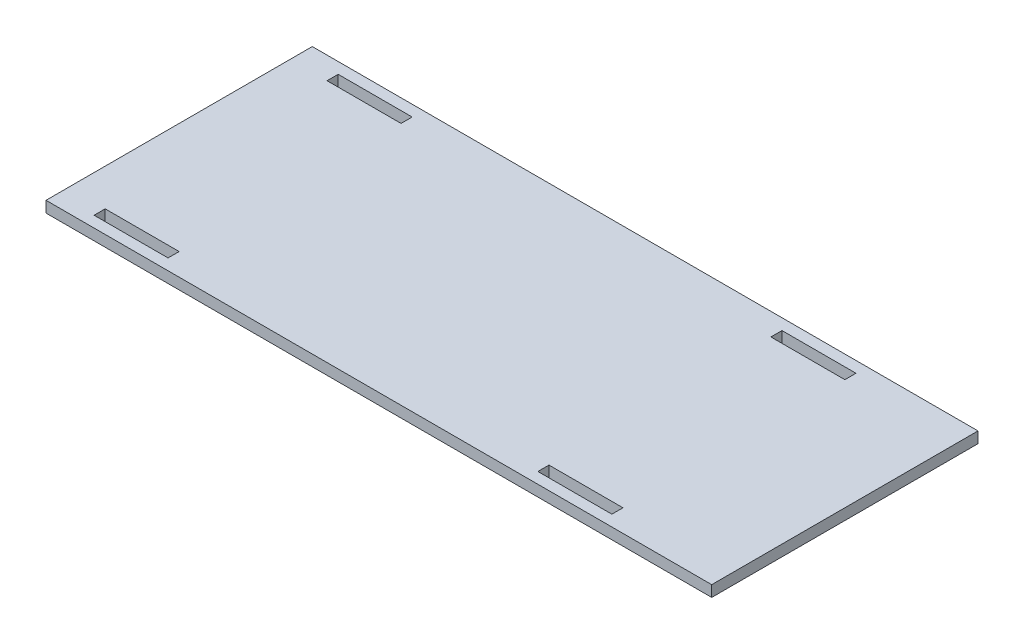
ISO-10303-21;
HEADER;
FILE_DESCRIPTION(('STEP AP214'),'2;1');
FILE_NAME('part.step','',(''),(''),'','','');
FILE_SCHEMA(('AUTOMOTIVE_DESIGN { 1 0 10303 214 1 1 1 1 }'));
ENDSEC;
DATA;
#1=APPLICATION_CONTEXT('core data for automotive mechanical design processes');
#2=APPLICATION_PROTOCOL_DEFINITION('international standard','automotive_design',2000,#1);
#3=PRODUCT_CONTEXT('',#1,'mechanical');
#4=PRODUCT('Part','Part','',(#3));
#5=PRODUCT_RELATED_PRODUCT_CATEGORY('part','',(#4));
#6=PRODUCT_DEFINITION_FORMATION('','',#4);
#7=PRODUCT_DEFINITION_CONTEXT('part definition',#1,'design');
#8=PRODUCT_DEFINITION('design','',#6,#7);
#9=PRODUCT_DEFINITION_SHAPE('','',#8);
#10=(LENGTH_UNIT() NAMED_UNIT(*) SI_UNIT(.MILLI.,.METRE.));
#11=(NAMED_UNIT(*) PLANE_ANGLE_UNIT() SI_UNIT($,.RADIAN.));
#12=(NAMED_UNIT(*) SI_UNIT($,.STERADIAN.) SOLID_ANGLE_UNIT());
#13=UNCERTAINTY_MEASURE_WITH_UNIT(LENGTH_MEASURE(1.E-05),#10,'distance_accuracy_value','');
#14=(GEOMETRIC_REPRESENTATION_CONTEXT(3) GLOBAL_UNCERTAINTY_ASSIGNED_CONTEXT((#13)) GLOBAL_UNIT_ASSIGNED_CONTEXT((#10,
#11,#12)) REPRESENTATION_CONTEXT('',''));
#15=CARTESIAN_POINT('',(0.,0.,0.));
#16=DIRECTION('',(0.,0.,1.));
#17=DIRECTION('',(1.,0.,0.));
#18=AXIS2_PLACEMENT_3D('',#15,#16,#17);
#19=CARTESIAN_POINT('',(0.,-3.,0.));
#20=DIRECTION('',(0.,-1.,0.));
#21=DIRECTION('',(0.,0.,-1.));
#22=AXIS2_PLACEMENT_3D('',#19,#20,#21);
#23=PLANE('',#22);
#24=DIRECTION('',(0.,0.,-1.));
#25=VECTOR('',#24,1.);
#26=CARTESIAN_POINT('',(-180.,-3.,3.));
#27=LINE('',#26,#25);
#28=CARTESIAN_POINT('',(-180.,-3.,3.));
#29=VERTEX_POINT('',#28);
#30=CARTESIAN_POINT('',(-180.,-3.,-69.));
#31=VERTEX_POINT('',#30);
#32=EDGE_CURVE('E301',#29,#31,#27,.T.);
#33=ORIENTED_EDGE('',*,*,#32,.T.);
#34=DIRECTION('',(1.,0.,0.));
#35=VECTOR('',#34,1.);
#36=CARTESIAN_POINT('',(-180.,-3.,-69.));
#37=LINE('',#36,#35);
#38=CARTESIAN_POINT('',(0.,-3.,-69.));
#39=VERTEX_POINT('',#38);
#40=EDGE_CURVE('E304',#31,#39,#37,.T.);
#41=ORIENTED_EDGE('',*,*,#40,.T.);
#42=DIRECTION('',(0.,0.,1.));
#43=VECTOR('',#42,1.);
#44=CARTESIAN_POINT('',(0.,-3.,3.));
#45=LINE('',#44,#43);
#46=CARTESIAN_POINT('',(0.,-3.,3.));
#47=VERTEX_POINT('',#46);
#48=EDGE_CURVE('E307',#39,#47,#45,.T.);
#49=ORIENTED_EDGE('',*,*,#48,.T.);
#50=DIRECTION('',(-1.,0.,0.));
#51=VECTOR('',#50,1.);
#52=CARTESIAN_POINT('',(-180.,-3.,3.));
#53=LINE('',#52,#51);
#54=EDGE_CURVE('E309',#47,#29,#53,.T.);
#55=ORIENTED_EDGE('',*,*,#54,.T.);
#56=EDGE_LOOP('',(#33,#41,#49,#55));
#57=FACE_BOUND('',#56,.T.);
#58=DIRECTION('',(-1.,0.,0.));
#59=VECTOR('',#58,1.);
#60=CARTESIAN_POINT('',(-150.,-3.,0.));
#61=LINE('',#60,#59);
#62=CARTESIAN_POINT('',(-150.,-3.,0.));
#63=VERTEX_POINT('',#62);
#64=CARTESIAN_POINT('',(-170.,-3.,0.));
#65=VERTEX_POINT('',#64);
#66=EDGE_CURVE('E272',#63,#65,#61,.T.);
#67=ORIENTED_EDGE('',*,*,#66,.F.);
#68=DIRECTION('',(0.,0.,1.));
#69=VECTOR('',#68,1.);
#70=CARTESIAN_POINT('',(-150.,-3.,-3.00000000000002));
#71=LINE('',#70,#69);
#72=CARTESIAN_POINT('',(-150.,-3.,-3.00000000000002));
#73=VERTEX_POINT('',#72);
#74=EDGE_CURVE('E270',#73,#63,#71,.T.);
#75=ORIENTED_EDGE('',*,*,#74,.F.);
#76=DIRECTION('',(1.,0.,0.));
#77=VECTOR('',#76,1.);
#78=CARTESIAN_POINT('',(-150.,-3.,-3.00000000000002));
#79=LINE('',#78,#77);
#80=CARTESIAN_POINT('',(-170.,-3.,-3.00000000000002));
#81=VERTEX_POINT('',#80);
#82=EDGE_CURVE('E278',#81,#73,#79,.T.);
#83=ORIENTED_EDGE('',*,*,#82,.F.);
#84=DIRECTION('',(0.,0.,-1.));
#85=VECTOR('',#84,1.);
#86=CARTESIAN_POINT('',(-170.,-3.,-3.00000000000002));
#87=LINE('',#86,#85);
#88=EDGE_CURVE('E275',#65,#81,#87,.T.);
#89=ORIENTED_EDGE('',*,*,#88,.F.);
#90=EDGE_LOOP('',(#67,#75,#83,#89));
#91=FACE_BOUND('',#90,.T.);
#92=DIRECTION('',(-1.,0.,0.));
#93=VECTOR('',#92,1.);
#94=CARTESIAN_POINT('',(-30.,-3.,0.));
#95=LINE('',#94,#93);
#96=CARTESIAN_POINT('',(-30.,-3.,0.));
#97=VERTEX_POINT('',#96);
#98=CARTESIAN_POINT('',(-50.,-3.,0.));
#99=VERTEX_POINT('',#98);
#100=EDGE_CURVE('E241',#97,#99,#95,.T.);
#101=ORIENTED_EDGE('',*,*,#100,.F.);
#102=DIRECTION('',(0.,0.,1.));
#103=VECTOR('',#102,1.);
#104=CARTESIAN_POINT('',(-30.,-3.,0.));
#105=LINE('',#104,#103);
#106=CARTESIAN_POINT('',(-30.,-3.,-3.00000000000002));
#107=VERTEX_POINT('',#106);
#108=EDGE_CURVE('E239',#107,#97,#105,.T.);
#109=ORIENTED_EDGE('',*,*,#108,.F.);
#110=DIRECTION('',(1.,0.,0.));
#111=VECTOR('',#110,1.);
#112=CARTESIAN_POINT('',(-30.,-3.,-3.00000000000002));
#113=LINE('',#112,#111);
#114=CARTESIAN_POINT('',(-50.,-3.,-3.00000000000002));
#115=VERTEX_POINT('',#114);
#116=EDGE_CURVE('E247',#115,#107,#113,.T.);
#117=ORIENTED_EDGE('',*,*,#116,.F.);
#118=DIRECTION('',(0.,0.,-1.));
#119=VECTOR('',#118,1.);
#120=CARTESIAN_POINT('',(-50.,-3.,0.));
#121=LINE('',#120,#119);
#122=EDGE_CURVE('E244',#99,#115,#121,.T.);
#123=ORIENTED_EDGE('',*,*,#122,.F.);
#124=EDGE_LOOP('',(#101,#109,#117,#123));
#125=FACE_BOUND('',#124,.T.);
#126=DIRECTION('',(-1.,0.,0.));
#127=VECTOR('',#126,1.);
#128=CARTESIAN_POINT('',(-30.,-3.,-63.));
#129=LINE('',#128,#127);
#130=CARTESIAN_POINT('',(-30.,-3.,-63.));
#131=VERTEX_POINT('',#130);
#132=CARTESIAN_POINT('',(-50.,-3.,-63.));
#133=VERTEX_POINT('',#132);
#134=EDGE_CURVE('E210',#131,#133,#129,.T.);
#135=ORIENTED_EDGE('',*,*,#134,.F.);
#136=DIRECTION('',(0.,0.,1.));
#137=VECTOR('',#136,1.);
#138=CARTESIAN_POINT('',(-30.,-3.,-63.));
#139=LINE('',#138,#137);
#140=CARTESIAN_POINT('',(-30.,-3.,-66.));
#141=VERTEX_POINT('',#140);
#142=EDGE_CURVE('E208',#141,#131,#139,.T.);
#143=ORIENTED_EDGE('',*,*,#142,.F.);
#144=DIRECTION('',(1.,0.,0.));
#145=VECTOR('',#144,1.);
#146=CARTESIAN_POINT('',(-30.,-3.,-66.));
#147=LINE('',#146,#145);
#148=CARTESIAN_POINT('',(-50.,-3.,-66.));
#149=VERTEX_POINT('',#148);
#150=EDGE_CURVE('E216',#149,#141,#147,.T.);
#151=ORIENTED_EDGE('',*,*,#150,.F.);
#152=DIRECTION('',(0.,0.,-1.));
#153=VECTOR('',#152,1.);
#154=CARTESIAN_POINT('',(-50.,-3.,-63.));
#155=LINE('',#154,#153);
#156=EDGE_CURVE('E213',#133,#149,#155,.T.);
#157=ORIENTED_EDGE('',*,*,#156,.F.);
#158=EDGE_LOOP('',(#135,#143,#151,#157));
#159=FACE_BOUND('',#158,.T.);
#160=DIRECTION('',(-1.,0.,0.));
#161=VECTOR('',#160,1.);
#162=CARTESIAN_POINT('',(-150.,-3.,-63.));
#163=LINE('',#162,#161);
#164=CARTESIAN_POINT('',(-150.,-3.,-63.));
#165=VERTEX_POINT('',#164);
#166=CARTESIAN_POINT('',(-170.,-3.,-63.));
#167=VERTEX_POINT('',#166);
#168=EDGE_CURVE('E180',#165,#167,#163,.T.);
#169=ORIENTED_EDGE('',*,*,#168,.F.);
#170=DIRECTION('',(0.,0.,1.));
#171=VECTOR('',#170,1.);
#172=CARTESIAN_POINT('',(-150.,-3.,-63.));
#173=LINE('',#172,#171);
#174=CARTESIAN_POINT('',(-150.,-3.,-66.));
#175=VERTEX_POINT('',#174);
#176=EDGE_CURVE('E172',#175,#165,#173,.T.);
#177=ORIENTED_EDGE('',*,*,#176,.F.);
#178=DIRECTION('',(1.,0.,0.));
#179=VECTOR('',#178,1.);
#180=CARTESIAN_POINT('',(-150.,-3.,-66.));
#181=LINE('',#180,#179);
#182=CARTESIAN_POINT('',(-170.,-3.,-66.));
#183=VERTEX_POINT('',#182);
#184=EDGE_CURVE('E194',#183,#175,#181,.T.);
#185=ORIENTED_EDGE('',*,*,#184,.F.);
#186=DIRECTION('',(0.,0.,-1.));
#187=VECTOR('',#186,1.);
#188=CARTESIAN_POINT('',(-170.,-3.,-63.));
#189=LINE('',#188,#187);
#190=EDGE_CURVE('E192',#167,#183,#189,.T.);
#191=ORIENTED_EDGE('',*,*,#190,.F.);
#192=EDGE_LOOP('',(#169,#177,#185,#191));
#193=FACE_BOUND('',#192,.T.);
#194=ADVANCED_FACE('F35',(#57,#91,#125,#159,#193),#23,.T.);
#195=CARTESIAN_POINT('',(0.,0.,0.));
#196=DIRECTION('',(0.,-1.,0.));
#197=DIRECTION('',(0.,0.,-1.));
#198=AXIS2_PLACEMENT_3D('',#195,#196,#197);
#199=PLANE('',#198);
#200=DIRECTION('',(0.,0.,1.));
#201=VECTOR('',#200,1.);
#202=CARTESIAN_POINT('',(-30.,0.,-63.));
#203=LINE('',#202,#201);
#204=CARTESIAN_POINT('',(-30.,0.,-66.));
#205=VERTEX_POINT('',#204);
#206=CARTESIAN_POINT('',(-30.,0.,-63.));
#207=VERTEX_POINT('',#206);
#208=EDGE_CURVE('E188',#205,#207,#203,.T.);
#209=ORIENTED_EDGE('',*,*,#208,.T.);
#210=DIRECTION('',(-1.,0.,0.));
#211=VECTOR('',#210,1.);
#212=CARTESIAN_POINT('',(-30.,0.,-63.));
#213=LINE('',#212,#211);
#214=CARTESIAN_POINT('',(-50.,0.,-63.));
#215=VERTEX_POINT('',#214);
#216=EDGE_CURVE('E221',#207,#215,#213,.T.);
#217=ORIENTED_EDGE('',*,*,#216,.T.);
#218=DIRECTION('',(0.,0.,-1.));
#219=VECTOR('',#218,1.);
#220=CARTESIAN_POINT('',(-50.,0.,-63.));
#221=LINE('',#220,#219);
#222=CARTESIAN_POINT('',(-50.,0.,-66.));
#223=VERTEX_POINT('',#222);
#224=EDGE_CURVE('E224',#215,#223,#221,.T.);
#225=ORIENTED_EDGE('',*,*,#224,.T.);
#226=DIRECTION('',(1.,0.,0.));
#227=VECTOR('',#226,1.);
#228=CARTESIAN_POINT('',(-30.,0.,-66.));
#229=LINE('',#228,#227);
#230=EDGE_CURVE('E211',#223,#205,#229,.T.);
#231=ORIENTED_EDGE('',*,*,#230,.T.);
#232=EDGE_LOOP('',(#209,#217,#225,#231));
#233=FACE_BOUND('',#232,.T.);
#234=DIRECTION('',(0.,0.,1.));
#235=VECTOR('',#234,1.);
#236=CARTESIAN_POINT('',(-150.,0.,-3.00000000000002));
#237=LINE('',#236,#235);
#238=CARTESIAN_POINT('',(-150.,0.,-3.00000000000002));
#239=VERTEX_POINT('',#238);
#240=CARTESIAN_POINT('',(-150.,0.,0.));
#241=VERTEX_POINT('',#240);
#242=EDGE_CURVE('E269',#239,#241,#237,.T.);
#243=ORIENTED_EDGE('',*,*,#242,.T.);
#244=DIRECTION('',(-1.,0.,0.));
#245=VECTOR('',#244,1.);
#246=CARTESIAN_POINT('',(-150.,0.,0.));
#247=LINE('',#246,#245);
#248=CARTESIAN_POINT('',(-170.,0.,0.));
#249=VERTEX_POINT('',#248);
#250=EDGE_CURVE('E283',#241,#249,#247,.T.);
#251=ORIENTED_EDGE('',*,*,#250,.T.);
#252=DIRECTION('',(0.,0.,-1.));
#253=VECTOR('',#252,1.);
#254=CARTESIAN_POINT('',(-170.,0.,-3.00000000000002));
#255=LINE('',#254,#253);
#256=CARTESIAN_POINT('',(-170.,0.,-3.00000000000002));
#257=VERTEX_POINT('',#256);
#258=EDGE_CURVE('E286',#249,#257,#255,.T.);
#259=ORIENTED_EDGE('',*,*,#258,.T.);
#260=DIRECTION('',(1.,0.,0.));
#261=VECTOR('',#260,1.);
#262=CARTESIAN_POINT('',(-150.,0.,-3.00000000000002));
#263=LINE('',#262,#261);
#264=EDGE_CURVE('E273',#257,#239,#263,.T.);
#265=ORIENTED_EDGE('',*,*,#264,.T.);
#266=EDGE_LOOP('',(#243,#251,#259,#265));
#267=FACE_BOUND('',#266,.T.);
#268=DIRECTION('',(0.,0.,-1.));
#269=VECTOR('',#268,1.);
#270=CARTESIAN_POINT('',(-180.,0.,3.));
#271=LINE('',#270,#269);
#272=CARTESIAN_POINT('',(-180.,0.,3.));
#273=VERTEX_POINT('',#272);
#274=CARTESIAN_POINT('',(-180.,0.,-69.));
#275=VERTEX_POINT('',#274);
#276=EDGE_CURVE('E300',#273,#275,#271,.T.);
#277=ORIENTED_EDGE('',*,*,#276,.F.);
#278=DIRECTION('',(-1.,0.,0.));
#279=VECTOR('',#278,1.);
#280=CARTESIAN_POINT('',(-180.,0.,3.));
#281=LINE('',#280,#279);
#282=CARTESIAN_POINT('',(0.,0.,3.));
#283=VERTEX_POINT('',#282);
#284=EDGE_CURVE('E305',#283,#273,#281,.T.);
#285=ORIENTED_EDGE('',*,*,#284,.F.);
#286=DIRECTION('',(0.,0.,1.));
#287=VECTOR('',#286,1.);
#288=CARTESIAN_POINT('',(0.,0.,3.));
#289=LINE('',#288,#287);
#290=CARTESIAN_POINT('',(0.,0.,-69.));
#291=VERTEX_POINT('',#290);
#292=EDGE_CURVE('E316',#291,#283,#289,.T.);
#293=ORIENTED_EDGE('',*,*,#292,.F.);
#294=DIRECTION('',(1.,0.,0.));
#295=VECTOR('',#294,1.);
#296=CARTESIAN_POINT('',(-180.,0.,-69.));
#297=LINE('',#296,#295);
#298=EDGE_CURVE('E314',#275,#291,#297,.T.);
#299=ORIENTED_EDGE('',*,*,#298,.F.);
#300=EDGE_LOOP('',(#277,#285,#293,#299));
#301=FACE_BOUND('',#300,.T.);
#302=DIRECTION('',(0.,0.,1.));
#303=VECTOR('',#302,1.);
#304=CARTESIAN_POINT('',(-30.,0.,0.));
#305=LINE('',#304,#303);
#306=CARTESIAN_POINT('',(-30.,0.,-3.00000000000002));
#307=VERTEX_POINT('',#306);
#308=CARTESIAN_POINT('',(-30.,0.,0.));
#309=VERTEX_POINT('',#308);
#310=EDGE_CURVE('E238',#307,#309,#305,.T.);
#311=ORIENTED_EDGE('',*,*,#310,.T.);
#312=DIRECTION('',(-1.,0.,0.));
#313=VECTOR('',#312,1.);
#314=CARTESIAN_POINT('',(-30.,0.,0.));
#315=LINE('',#314,#313);
#316=CARTESIAN_POINT('',(-50.,0.,0.));
#317=VERTEX_POINT('',#316);
#318=EDGE_CURVE('E252',#309,#317,#315,.T.);
#319=ORIENTED_EDGE('',*,*,#318,.T.);
#320=DIRECTION('',(0.,0.,-1.));
#321=VECTOR('',#320,1.);
#322=CARTESIAN_POINT('',(-50.,0.,0.));
#323=LINE('',#322,#321);
#324=CARTESIAN_POINT('',(-50.,0.,-3.00000000000002));
#325=VERTEX_POINT('',#324);
#326=EDGE_CURVE('E255',#317,#325,#323,.T.);
#327=ORIENTED_EDGE('',*,*,#326,.T.);
#328=DIRECTION('',(1.,0.,0.));
#329=VECTOR('',#328,1.);
#330=CARTESIAN_POINT('',(-30.,0.,-3.00000000000002));
#331=LINE('',#330,#329);
#332=EDGE_CURVE('E242',#325,#307,#331,.T.);
#333=ORIENTED_EDGE('',*,*,#332,.T.);
#334=EDGE_LOOP('',(#311,#319,#327,#333));
#335=FACE_BOUND('',#334,.T.);
#336=DIRECTION('',(0.,0.,1.));
#337=VECTOR('',#336,1.);
#338=CARTESIAN_POINT('',(-150.,0.,-63.));
#339=LINE('',#338,#337);
#340=CARTESIAN_POINT('',(-150.,0.,-66.));
#341=VERTEX_POINT('',#340);
#342=CARTESIAN_POINT('',(-150.,0.,-63.));
#343=VERTEX_POINT('',#342);
#344=EDGE_CURVE('E58',#341,#343,#339,.T.);
#345=ORIENTED_EDGE('',*,*,#344,.T.);
#346=DIRECTION('',(-1.,0.,0.));
#347=VECTOR('',#346,1.);
#348=CARTESIAN_POINT('',(-150.,0.,-63.));
#349=LINE('',#348,#347);
#350=CARTESIAN_POINT('',(-170.,0.,-63.));
#351=VERTEX_POINT('',#350);
#352=EDGE_CURVE('E187',#343,#351,#349,.T.);
#353=ORIENTED_EDGE('',*,*,#352,.T.);
#354=DIRECTION('',(0.,0.,-1.));
#355=VECTOR('',#354,1.);
#356=CARTESIAN_POINT('',(-170.,0.,-63.));
#357=LINE('',#356,#355);
#358=CARTESIAN_POINT('',(-170.,0.,-66.));
#359=VERTEX_POINT('',#358);
#360=EDGE_CURVE('E200',#351,#359,#357,.T.);
#361=ORIENTED_EDGE('',*,*,#360,.T.);
#362=DIRECTION('',(1.,0.,0.));
#363=VECTOR('',#362,1.);
#364=CARTESIAN_POINT('',(-150.,0.,-66.));
#365=LINE('',#364,#363);
#366=EDGE_CURVE('E181',#359,#341,#365,.T.);
#367=ORIENTED_EDGE('',*,*,#366,.T.);
#368=EDGE_LOOP('',(#345,#353,#361,#367));
#369=FACE_BOUND('',#368,.T.);
#370=ADVANCED_FACE('F334',(#233,#267,#301,#335,#369),#199,.F.);
#371=CARTESIAN_POINT('',(-180.,-3.,3.));
#372=DIRECTION('',(1.,0.,0.));
#373=DIRECTION('',(0.,0.,-1.));
#374=AXIS2_PLACEMENT_3D('',#371,#372,#373);
#375=PLANE('',#374);
#376=ORIENTED_EDGE('',*,*,#276,.T.);
#377=DIRECTION('',(0.,1.,0.));
#378=VECTOR('',#377,1.);
#379=CARTESIAN_POINT('',(-180.,-3.,-69.));
#380=LINE('',#379,#378);
#381=EDGE_CURVE('E11',#31,#275,#380,.T.);
#382=ORIENTED_EDGE('',*,*,#381,.F.);
#383=ORIENTED_EDGE('',*,*,#32,.F.);
#384=DIRECTION('',(0.,1.,0.));
#385=VECTOR('',#384,1.);
#386=CARTESIAN_POINT('',(-180.,-3.,3.));
#387=LINE('',#386,#385);
#388=EDGE_CURVE('E311',#29,#273,#387,.T.);
#389=ORIENTED_EDGE('',*,*,#388,.T.);
#390=EDGE_LOOP('',(#376,#382,#383,#389));
#391=FACE_BOUND('',#390,.T.);
#392=ADVANCED_FACE('F37',(#391),#375,.F.);
#393=CARTESIAN_POINT('',(-180.,-3.,-69.));
#394=DIRECTION('',(0.,0.,1.));
#395=DIRECTION('',(1.,0.,0.));
#396=AXIS2_PLACEMENT_3D('',#393,#394,#395);
#397=PLANE('',#396);
#398=ORIENTED_EDGE('',*,*,#298,.T.);
#399=DIRECTION('',(0.,1.,0.));
#400=VECTOR('',#399,1.);
#401=CARTESIAN_POINT('',(0.,-3.,-69.));
#402=LINE('',#401,#400);
#403=EDGE_CURVE('E43',#39,#291,#402,.T.);
#404=ORIENTED_EDGE('',*,*,#403,.F.);
#405=ORIENTED_EDGE('',*,*,#40,.F.);
#406=ORIENTED_EDGE('',*,*,#381,.T.);
#407=EDGE_LOOP('',(#398,#404,#405,#406));
#408=FACE_BOUND('',#407,.T.);
#409=ADVANCED_FACE('F345',(#408),#397,.F.);
#410=CARTESIAN_POINT('',(0.,-3.,3.));
#411=DIRECTION('',(-1.,0.,0.));
#412=DIRECTION('',(0.,0.,1.));
#413=AXIS2_PLACEMENT_3D('',#410,#411,#412);
#414=PLANE('',#413);
#415=ORIENTED_EDGE('',*,*,#292,.T.);
#416=DIRECTION('',(0.,1.,0.));
#417=VECTOR('',#416,1.);
#418=CARTESIAN_POINT('',(0.,-3.,3.));
#419=LINE('',#418,#417);
#420=EDGE_CURVE('E321',#47,#283,#419,.T.);
#421=ORIENTED_EDGE('',*,*,#420,.F.);
#422=ORIENTED_EDGE('',*,*,#48,.F.);
#423=ORIENTED_EDGE('',*,*,#403,.T.);
#424=EDGE_LOOP('',(#415,#421,#422,#423));
#425=FACE_BOUND('',#424,.T.);
#426=ADVANCED_FACE('F328',(#425),#414,.F.);
#427=CARTESIAN_POINT('',(-180.,-3.,3.));
#428=DIRECTION('',(0.,0.,-1.));
#429=DIRECTION('',(-1.,0.,0.));
#430=AXIS2_PLACEMENT_3D('',#427,#428,#429);
#431=PLANE('',#430);
#432=ORIENTED_EDGE('',*,*,#284,.T.);
#433=ORIENTED_EDGE('',*,*,#388,.F.);
#434=ORIENTED_EDGE('',*,*,#54,.F.);
#435=ORIENTED_EDGE('',*,*,#420,.T.);
#436=EDGE_LOOP('',(#432,#433,#434,#435));
#437=FACE_BOUND('',#436,.T.);
#438=ADVANCED_FACE('F338',(#437),#431,.F.);
#439=CARTESIAN_POINT('',(-150.,-3.,-3.00000000000002));
#440=DIRECTION('',(-1.,0.,0.));
#441=DIRECTION('',(0.,0.,1.));
#442=AXIS2_PLACEMENT_3D('',#439,#440,#441);
#443=PLANE('',#442);
#444=ORIENTED_EDGE('',*,*,#242,.F.);
#445=DIRECTION('',(0.,1.,0.));
#446=VECTOR('',#445,1.);
#447=CARTESIAN_POINT('',(-150.,-3.,-3.00000000000002));
#448=LINE('',#447,#446);
#449=EDGE_CURVE('E280',#73,#239,#448,.T.);
#450=ORIENTED_EDGE('',*,*,#449,.F.);
#451=ORIENTED_EDGE('',*,*,#74,.T.);
#452=DIRECTION('',(0.,1.,0.));
#453=VECTOR('',#452,1.);
#454=CARTESIAN_POINT('',(-150.,-3.,0.));
#455=LINE('',#454,#453);
#456=EDGE_CURVE('E297',#63,#241,#455,.T.);
#457=ORIENTED_EDGE('',*,*,#456,.T.);
#458=EDGE_LOOP('',(#444,#450,#451,#457));
#459=FACE_BOUND('',#458,.T.);
#460=ADVANCED_FACE('F360',(#459),#443,.T.);
#461=CARTESIAN_POINT('',(-150.,-3.,0.));
#462=DIRECTION('',(0.,0.,-1.));
#463=DIRECTION('',(-1.,0.,0.));
#464=AXIS2_PLACEMENT_3D('',#461,#462,#463);
#465=PLANE('',#464);
#466=ORIENTED_EDGE('',*,*,#250,.F.);
#467=ORIENTED_EDGE('',*,*,#456,.F.);
#468=ORIENTED_EDGE('',*,*,#66,.T.);
#469=DIRECTION('',(0.,1.,0.));
#470=VECTOR('',#469,1.);
#471=CARTESIAN_POINT('',(-170.,-3.,0.));
#472=LINE('',#471,#470);
#473=EDGE_CURVE('E295',#65,#249,#472,.T.);
#474=ORIENTED_EDGE('',*,*,#473,.T.);
#475=EDGE_LOOP('',(#466,#467,#468,#474));
#476=FACE_BOUND('',#475,.T.);
#477=ADVANCED_FACE('F367',(#476),#465,.T.);
#478=CARTESIAN_POINT('',(-170.,-3.,-3.00000000000002));
#479=DIRECTION('',(1.,0.,0.));
#480=DIRECTION('',(0.,0.,-1.));
#481=AXIS2_PLACEMENT_3D('',#478,#479,#480);
#482=PLANE('',#481);
#483=ORIENTED_EDGE('',*,*,#258,.F.);
#484=ORIENTED_EDGE('',*,*,#473,.F.);
#485=ORIENTED_EDGE('',*,*,#88,.T.);
#486=DIRECTION('',(0.,1.,0.));
#487=VECTOR('',#486,1.);
#488=CARTESIAN_POINT('',(-170.,-3.,-3.00000000000002));
#489=LINE('',#488,#487);
#490=EDGE_CURVE('E293',#81,#257,#489,.T.);
#491=ORIENTED_EDGE('',*,*,#490,.T.);
#492=EDGE_LOOP('',(#483,#484,#485,#491));
#493=FACE_BOUND('',#492,.T.);
#494=ADVANCED_FACE('F372',(#493),#482,.T.);
#495=CARTESIAN_POINT('',(-150.,-3.,-3.00000000000002));
#496=DIRECTION('',(0.,0.,1.));
#497=DIRECTION('',(1.,0.,0.));
#498=AXIS2_PLACEMENT_3D('',#495,#496,#497);
#499=PLANE('',#498);
#500=ORIENTED_EDGE('',*,*,#264,.F.);
#501=ORIENTED_EDGE('',*,*,#490,.F.);
#502=ORIENTED_EDGE('',*,*,#82,.T.);
#503=ORIENTED_EDGE('',*,*,#449,.T.);
#504=EDGE_LOOP('',(#500,#501,#502,#503));
#505=FACE_BOUND('',#504,.T.);
#506=ADVANCED_FACE('F380',(#505),#499,.T.);
#507=CARTESIAN_POINT('',(-30.,-3.,0.));
#508=DIRECTION('',(-1.,0.,0.));
#509=DIRECTION('',(0.,0.,1.));
#510=AXIS2_PLACEMENT_3D('',#507,#508,#509);
#511=PLANE('',#510);
#512=ORIENTED_EDGE('',*,*,#310,.F.);
#513=DIRECTION('',(0.,1.,0.));
#514=VECTOR('',#513,1.);
#515=CARTESIAN_POINT('',(-30.,-3.,-3.00000000000002));
#516=LINE('',#515,#514);
#517=EDGE_CURVE('E249',#107,#307,#516,.T.);
#518=ORIENTED_EDGE('',*,*,#517,.F.);
#519=ORIENTED_EDGE('',*,*,#108,.T.);
#520=DIRECTION('',(0.,1.,0.));
#521=VECTOR('',#520,1.);
#522=CARTESIAN_POINT('',(-30.,-3.,0.));
#523=LINE('',#522,#521);
#524=EDGE_CURVE('E266',#97,#309,#523,.T.);
#525=ORIENTED_EDGE('',*,*,#524,.T.);
#526=EDGE_LOOP('',(#512,#518,#519,#525));
#527=FACE_BOUND('',#526,.T.);
#528=ADVANCED_FACE('F434',(#527),#511,.T.);
#529=CARTESIAN_POINT('',(-30.,-3.,0.));
#530=DIRECTION('',(0.,0.,-1.));
#531=DIRECTION('',(-1.,0.,0.));
#532=AXIS2_PLACEMENT_3D('',#529,#530,#531);
#533=PLANE('',#532);
#534=ORIENTED_EDGE('',*,*,#318,.F.);
#535=ORIENTED_EDGE('',*,*,#524,.F.);
#536=ORIENTED_EDGE('',*,*,#100,.T.);
#537=DIRECTION('',(0.,1.,0.));
#538=VECTOR('',#537,1.);
#539=CARTESIAN_POINT('',(-50.,-3.,0.));
#540=LINE('',#539,#538);
#541=EDGE_CURVE('E264',#99,#317,#540,.T.);
#542=ORIENTED_EDGE('',*,*,#541,.T.);
#543=EDGE_LOOP('',(#534,#535,#536,#542));
#544=FACE_BOUND('',#543,.T.);
#545=ADVANCED_FACE('F430',(#544),#533,.T.);
#546=CARTESIAN_POINT('',(-50.,-3.,0.));
#547=DIRECTION('',(1.,0.,0.));
#548=DIRECTION('',(0.,0.,-1.));
#549=AXIS2_PLACEMENT_3D('',#546,#547,#548);
#550=PLANE('',#549);
#551=ORIENTED_EDGE('',*,*,#326,.F.);
#552=ORIENTED_EDGE('',*,*,#541,.F.);
#553=ORIENTED_EDGE('',*,*,#122,.T.);
#554=DIRECTION('',(0.,1.,0.));
#555=VECTOR('',#554,1.);
#556=CARTESIAN_POINT('',(-50.,-3.,-3.00000000000002));
#557=LINE('',#556,#555);
#558=EDGE_CURVE('E262',#115,#325,#557,.T.);
#559=ORIENTED_EDGE('',*,*,#558,.T.);
#560=EDGE_LOOP('',(#551,#552,#553,#559));
#561=FACE_BOUND('',#560,.T.);
#562=ADVANCED_FACE('F426',(#561),#550,.T.);
#563=CARTESIAN_POINT('',(-30.,-3.,-3.00000000000002));
#564=DIRECTION('',(0.,0.,1.));
#565=DIRECTION('',(1.,0.,0.));
#566=AXIS2_PLACEMENT_3D('',#563,#564,#565);
#567=PLANE('',#566);
#568=ORIENTED_EDGE('',*,*,#332,.F.);
#569=ORIENTED_EDGE('',*,*,#558,.F.);
#570=ORIENTED_EDGE('',*,*,#116,.T.);
#571=ORIENTED_EDGE('',*,*,#517,.T.);
#572=EDGE_LOOP('',(#568,#569,#570,#571));
#573=FACE_BOUND('',#572,.T.);
#574=ADVANCED_FACE('F423',(#573),#567,.T.);
#575=CARTESIAN_POINT('',(-30.,-3.,-63.));
#576=DIRECTION('',(-1.,0.,0.));
#577=DIRECTION('',(0.,0.,1.));
#578=AXIS2_PLACEMENT_3D('',#575,#576,#577);
#579=PLANE('',#578);
#580=ORIENTED_EDGE('',*,*,#208,.F.);
#581=DIRECTION('',(0.,1.,0.));
#582=VECTOR('',#581,1.);
#583=CARTESIAN_POINT('',(-30.,-3.,-66.));
#584=LINE('',#583,#582);
#585=EDGE_CURVE('E218',#141,#205,#584,.T.);
#586=ORIENTED_EDGE('',*,*,#585,.F.);
#587=ORIENTED_EDGE('',*,*,#142,.T.);
#588=DIRECTION('',(0.,1.,0.));
#589=VECTOR('',#588,1.);
#590=CARTESIAN_POINT('',(-30.,-3.,-63.));
#591=LINE('',#590,#589);
#592=EDGE_CURVE('E235',#131,#207,#591,.T.);
#593=ORIENTED_EDGE('',*,*,#592,.T.);
#594=EDGE_LOOP('',(#580,#586,#587,#593));
#595=FACE_BOUND('',#594,.T.);
#596=ADVANCED_FACE('F405',(#595),#579,.T.);
#597=CARTESIAN_POINT('',(-30.,-3.,-63.));
#598=DIRECTION('',(0.,0.,-1.));
#599=DIRECTION('',(-1.,0.,0.));
#600=AXIS2_PLACEMENT_3D('',#597,#598,#599);
#601=PLANE('',#600);
#602=ORIENTED_EDGE('',*,*,#216,.F.);
#603=ORIENTED_EDGE('',*,*,#592,.F.);
#604=ORIENTED_EDGE('',*,*,#134,.T.);
#605=DIRECTION('',(0.,1.,0.));
#606=VECTOR('',#605,1.);
#607=CARTESIAN_POINT('',(-50.,-3.,-63.));
#608=LINE('',#607,#606);
#609=EDGE_CURVE('E233',#133,#215,#608,.T.);
#610=ORIENTED_EDGE('',*,*,#609,.T.);
#611=EDGE_LOOP('',(#602,#603,#604,#610));
#612=FACE_BOUND('',#611,.T.);
#613=ADVANCED_FACE('F399',(#612),#601,.T.);
#614=CARTESIAN_POINT('',(-50.,-3.,-63.));
#615=DIRECTION('',(1.,0.,0.));
#616=DIRECTION('',(0.,0.,-1.));
#617=AXIS2_PLACEMENT_3D('',#614,#615,#616);
#618=PLANE('',#617);
#619=ORIENTED_EDGE('',*,*,#224,.F.);
#620=ORIENTED_EDGE('',*,*,#609,.F.);
#621=ORIENTED_EDGE('',*,*,#156,.T.);
#622=DIRECTION('',(0.,1.,0.));
#623=VECTOR('',#622,1.);
#624=CARTESIAN_POINT('',(-50.,-3.,-66.));
#625=LINE('',#624,#623);
#626=EDGE_CURVE('E231',#149,#223,#625,.T.);
#627=ORIENTED_EDGE('',*,*,#626,.T.);
#628=EDGE_LOOP('',(#619,#620,#621,#627));
#629=FACE_BOUND('',#628,.T.);
#630=ADVANCED_FACE('F402',(#629),#618,.T.);
#631=CARTESIAN_POINT('',(-30.,-3.,-66.));
#632=DIRECTION('',(0.,0.,1.));
#633=DIRECTION('',(1.,0.,0.));
#634=AXIS2_PLACEMENT_3D('',#631,#632,#633);
#635=PLANE('',#634);
#636=ORIENTED_EDGE('',*,*,#230,.F.);
#637=ORIENTED_EDGE('',*,*,#626,.F.);
#638=ORIENTED_EDGE('',*,*,#150,.T.);
#639=ORIENTED_EDGE('',*,*,#585,.T.);
#640=EDGE_LOOP('',(#636,#637,#638,#639));
#641=FACE_BOUND('',#640,.T.);
#642=ADVANCED_FACE('F408',(#641),#635,.T.);
#643=CARTESIAN_POINT('',(-150.,-3.,-63.));
#644=DIRECTION('',(-1.,0.,0.));
#645=DIRECTION('',(0.,0.,1.));
#646=AXIS2_PLACEMENT_3D('',#643,#644,#645);
#647=PLANE('',#646);
#648=ORIENTED_EDGE('',*,*,#344,.F.);
#649=DIRECTION('',(0.,1.,0.));
#650=VECTOR('',#649,1.);
#651=CARTESIAN_POINT('',(-150.,-3.,-66.));
#652=LINE('',#651,#650);
#653=EDGE_CURVE('E176',#175,#341,#652,.T.);
#654=ORIENTED_EDGE('',*,*,#653,.F.);
#655=ORIENTED_EDGE('',*,*,#176,.T.);
#656=DIRECTION('',(0.,1.,0.));
#657=VECTOR('',#656,1.);
#658=CARTESIAN_POINT('',(-150.,-3.,-63.));
#659=LINE('',#658,#657);
#660=EDGE_CURVE('E175',#165,#343,#659,.T.);
#661=ORIENTED_EDGE('',*,*,#660,.T.);
#662=EDGE_LOOP('',(#648,#654,#655,#661));
#663=FACE_BOUND('',#662,.T.);
#664=ADVANCED_FACE('F174',(#663),#647,.T.);
#665=CARTESIAN_POINT('',(-150.,-3.,-63.));
#666=DIRECTION('',(0.,0.,-1.));
#667=DIRECTION('',(-1.,0.,0.));
#668=AXIS2_PLACEMENT_3D('',#665,#666,#667);
#669=PLANE('',#668);
#670=ORIENTED_EDGE('',*,*,#352,.F.);
#671=ORIENTED_EDGE('',*,*,#660,.F.);
#672=ORIENTED_EDGE('',*,*,#168,.T.);
#673=DIRECTION('',(0.,1.,0.));
#674=VECTOR('',#673,1.);
#675=CARTESIAN_POINT('',(-170.,-3.,-63.));
#676=LINE('',#675,#674);
#677=EDGE_CURVE('E189',#167,#351,#676,.T.);
#678=ORIENTED_EDGE('',*,*,#677,.T.);
#679=EDGE_LOOP('',(#670,#671,#672,#678));
#680=FACE_BOUND('',#679,.T.);
#681=ADVANCED_FACE('F184',(#680),#669,.T.);
#682=CARTESIAN_POINT('',(-170.,-3.,-63.));
#683=DIRECTION('',(1.,0.,0.));
#684=DIRECTION('',(0.,0.,-1.));
#685=AXIS2_PLACEMENT_3D('',#682,#683,#684);
#686=PLANE('',#685);
#687=ORIENTED_EDGE('',*,*,#360,.F.);
#688=ORIENTED_EDGE('',*,*,#677,.F.);
#689=ORIENTED_EDGE('',*,*,#190,.T.);
#690=DIRECTION('',(0.,1.,0.));
#691=VECTOR('',#690,1.);
#692=CARTESIAN_POINT('',(-170.,-3.,-66.));
#693=LINE('',#692,#691);
#694=EDGE_CURVE('E50',#183,#359,#693,.T.);
#695=ORIENTED_EDGE('',*,*,#694,.T.);
#696=EDGE_LOOP('',(#687,#688,#689,#695));
#697=FACE_BOUND('',#696,.T.);
#698=ADVANCED_FACE('F507',(#697),#686,.T.);
#699=CARTESIAN_POINT('',(-150.,-3.,-66.));
#700=DIRECTION('',(0.,0.,1.));
#701=DIRECTION('',(1.,0.,0.));
#702=AXIS2_PLACEMENT_3D('',#699,#700,#701);
#703=PLANE('',#702);
#704=ORIENTED_EDGE('',*,*,#366,.F.);
#705=ORIENTED_EDGE('',*,*,#694,.F.);
#706=ORIENTED_EDGE('',*,*,#184,.T.);
#707=ORIENTED_EDGE('',*,*,#653,.T.);
#708=EDGE_LOOP('',(#704,#705,#706,#707));
#709=FACE_BOUND('',#708,.T.);
#710=ADVANCED_FACE('F515',(#709),#703,.T.);
#711=CLOSED_SHELL('',(#194,#370,#392,#409,#426,#438,#460,#477,#494,#506,#528,#545,#562,#574,
#596,#613,#630,#642,#664,#681,#698,#710));
#712=MANIFOLD_SOLID_BREP('B2',#711);
#713=ADVANCED_BREP_SHAPE_REPRESENTATION('',(#18,#712),#14);
#714=SHAPE_DEFINITION_REPRESENTATION(#9,#713);
ENDSEC;
END-ISO-10303-21;
